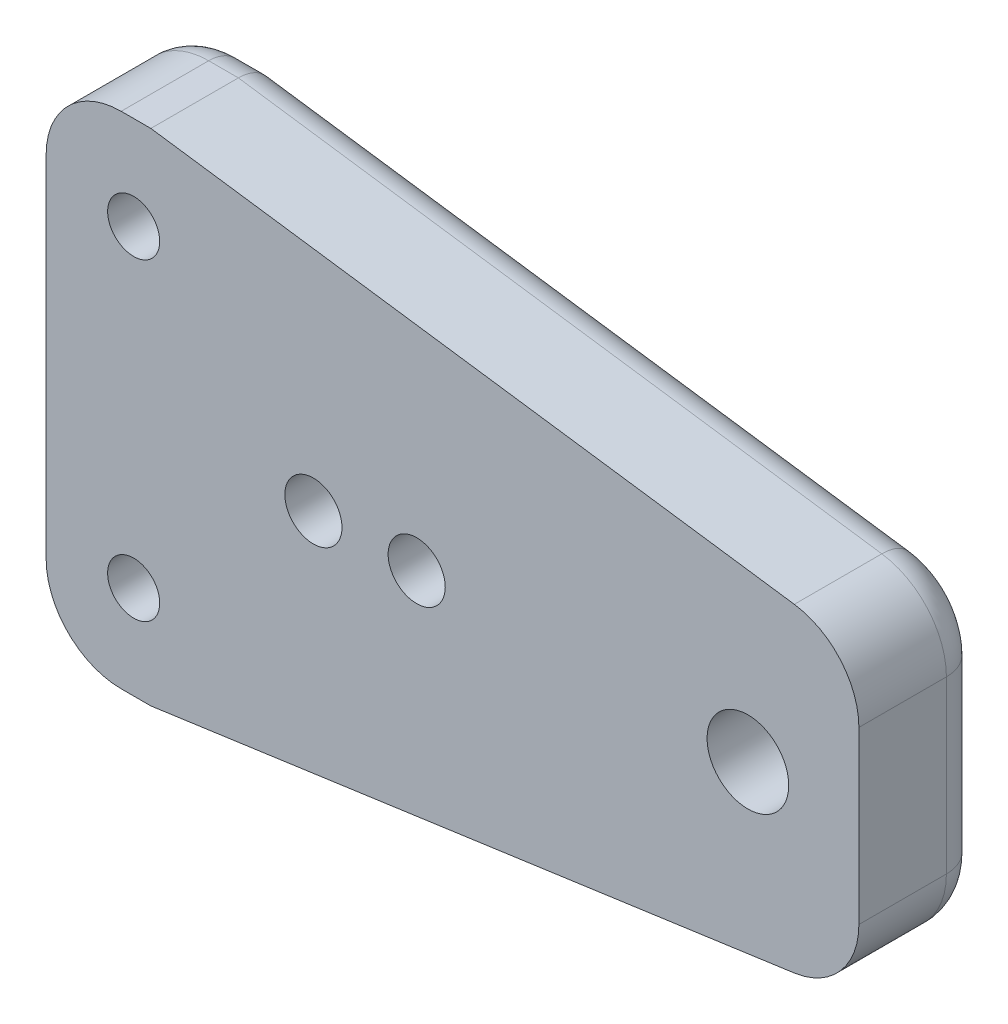
ISO-10303-21;
HEADER;
FILE_DESCRIPTION(('STEP AP214'),'2;1');
FILE_NAME('part.step','',(''),(''),'','','');
FILE_SCHEMA(('AUTOMOTIVE_DESIGN { 1 0 10303 214 1 1 1 1 }'));
ENDSEC;
DATA;
#1=APPLICATION_CONTEXT('core data for automotive mechanical design processes');
#2=APPLICATION_PROTOCOL_DEFINITION('international standard','automotive_design',2000,#1);
#3=PRODUCT_CONTEXT('',#1,'mechanical');
#4=PRODUCT('Part','Part','',(#3));
#5=PRODUCT_RELATED_PRODUCT_CATEGORY('part','',(#4));
#6=PRODUCT_DEFINITION_FORMATION('','',#4);
#7=PRODUCT_DEFINITION_CONTEXT('part definition',#1,'design');
#8=PRODUCT_DEFINITION('design','',#6,#7);
#9=PRODUCT_DEFINITION_SHAPE('','',#8);
#10=(LENGTH_UNIT() NAMED_UNIT(*) SI_UNIT(.MILLI.,.METRE.));
#11=(NAMED_UNIT(*) PLANE_ANGLE_UNIT() SI_UNIT($,.RADIAN.));
#12=(NAMED_UNIT(*) SI_UNIT($,.STERADIAN.) SOLID_ANGLE_UNIT());
#13=UNCERTAINTY_MEASURE_WITH_UNIT(LENGTH_MEASURE(1.E-05),#10,'distance_accuracy_value','');
#14=(GEOMETRIC_REPRESENTATION_CONTEXT(3) GLOBAL_UNCERTAINTY_ASSIGNED_CONTEXT((#13)) GLOBAL_UNIT_ASSIGNED_CONTEXT((#10,
#11,#12)) REPRESENTATION_CONTEXT('',''));
#15=CARTESIAN_POINT('',(0.,0.,0.));
#16=DIRECTION('',(0.,0.,1.));
#17=DIRECTION('',(1.,0.,0.));
#18=AXIS2_PLACEMENT_3D('',#15,#16,#17);
#19=CARTESIAN_POINT('',(-37.1241261867414,-6.82608205189177,10.));
#20=DIRECTION('',(0.,0.,-1.));
#21=DIRECTION('',(-1.,0.,0.));
#22=AXIS2_PLACEMENT_3D('',#19,#20,#21);
#23=PLANE('',#22);
#24=CARTESIAN_POINT('',(-74.7495761867413,0.,10.));
#25=DIRECTION('',(0.,0.,1.));
#26=DIRECTION('',(1.,0.,0.));
#27=AXIS2_PLACEMENT_3D('',#24,#25,#26);
#28=CIRCLE('',#27,2.28499999999999);
#29=CARTESIAN_POINT('',(-72.4645761867413,0.,10.));
#30=VERTEX_POINT('',#29);
#31=EDGE_CURVE('E300',#30,#30,#28,.T.);
#32=ORIENTED_EDGE('',*,*,#31,.F.);
#33=EDGE_LOOP('',(#32));
#34=FACE_BOUND('',#33,.T.);
#35=CARTESIAN_POINT('',(-66.4895761867413,0.,10.));
#36=DIRECTION('',(0.,0.,1.));
#37=DIRECTION('',(1.,0.,0.));
#38=AXIS2_PLACEMENT_3D('',#35,#36,#37);
#39=CIRCLE('',#38,2.28499999999999);
#40=CARTESIAN_POINT('',(-64.2045761867413,0.,10.));
#41=VERTEX_POINT('',#40);
#42=EDGE_CURVE('E306',#41,#41,#39,.T.);
#43=ORIENTED_EDGE('',*,*,#42,.F.);
#44=EDGE_LOOP('',(#43));
#45=FACE_BOUND('',#44,.T.);
#46=CARTESIAN_POINT('',(-40.,0.,10.));
#47=DIRECTION('',(0.,0.,1.));
#48=DIRECTION('',(1.,0.,0.));
#49=AXIS2_PLACEMENT_3D('',#46,#47,#48);
#50=CIRCLE('',#49,3.2639);
#51=CARTESIAN_POINT('',(-36.7361,0.,10.));
#52=VERTEX_POINT('',#51);
#53=EDGE_CURVE('E321',#52,#52,#50,.T.);
#54=ORIENTED_EDGE('',*,*,#53,.F.);
#55=EDGE_LOOP('',(#54));
#56=FACE_BOUND('',#55,.T.);
#57=CARTESIAN_POINT('',(-37.1241261867414,-6.82608205189177,10.));
#58=DIRECTION('',(0.,0.,1.));
#59=DIRECTION('',(-1.,0.,0.));
#60=AXIS2_PLACEMENT_3D('',#57,#58,#59);
#61=CIRCLE('',#60,6.);
#62=CARTESIAN_POINT('',(-36.2890875809811,-12.7676904643412,10.0000000000001));
#63=VERTEX_POINT('',#62);
#64=CARTESIAN_POINT('',(-31.1241261867414,-6.82608205189174,10.));
#65=VERTEX_POINT('',#64);
#66=EDGE_CURVE('E156',#63,#65,#61,.T.);
#67=ORIENTED_EDGE('',*,*,#66,.T.);
#68=DIRECTION('',(0.,1.,0.));
#69=VECTOR('',#68,1.);
#70=CARTESIAN_POINT('',(-31.1241261867414,6.82608205189166,9.99999999999997));
#71=LINE('',#70,#69);
#72=CARTESIAN_POINT('',(-31.1241261867414,6.82608205189166,9.99999999999997));
#73=VERTEX_POINT('',#72);
#74=EDGE_CURVE('E145',#65,#73,#71,.T.);
#75=ORIENTED_EDGE('',*,*,#74,.T.);
#76=CARTESIAN_POINT('',(-37.1241261867414,6.8260820518917,9.99999999999997));
#77=DIRECTION('',(0.,0.,1.));
#78=DIRECTION('',(-1.,0.,0.));
#79=AXIS2_PLACEMENT_3D('',#76,#77,#78);
#80=CIRCLE('',#79,6.);
#81=CARTESIAN_POINT('',(-36.2890875809811,12.7676904643411,9.99999999999993));
#82=VERTEX_POINT('',#81);
#83=EDGE_CURVE('E155',#73,#82,#80,.T.);
#84=ORIENTED_EDGE('',*,*,#83,.T.);
#85=DIRECTION('',(-0.990268068741571,0.139173100960058,0.));
#86=VECTOR('',#85,1.);
#87=CARTESIAN_POINT('',(-36.2890875809811,12.7676904643411,9.99999999999993));
#88=LINE('',#87,#86);
#89=CARTESIAN_POINT('',(-87.7496438739211,20.,9.9999999999999));
#90=VERTEX_POINT('',#89);
#91=EDGE_CURVE('E275',#82,#90,#88,.T.);
#92=ORIENTED_EDGE('',*,*,#91,.T.);
#93=DIRECTION('',(-1.,0.,0.));
#94=VECTOR('',#93,1.);
#95=CARTESIAN_POINT('',(-90.1241261867413,20.,9.9999999999999));
#96=LINE('',#95,#94);
#97=CARTESIAN_POINT('',(-90.1241261867413,20.,9.9999999999999));
#98=VERTEX_POINT('',#97);
#99=EDGE_CURVE('E331',#90,#98,#96,.T.);
#100=ORIENTED_EDGE('',*,*,#99,.T.);
#101=CARTESIAN_POINT('',(-90.1241261867413,13.9999999999999,9.99999999999993));
#102=DIRECTION('',(0.,0.,1.));
#103=DIRECTION('',(1.,0.,0.));
#104=AXIS2_PLACEMENT_3D('',#101,#102,#103);
#105=CIRCLE('',#104,6.);
#106=CARTESIAN_POINT('',(-96.1241261867413,13.9999999999999,9.99999999999993));
#107=VERTEX_POINT('',#106);
#108=EDGE_CURVE('E333',#98,#107,#105,.T.);
#109=ORIENTED_EDGE('',*,*,#108,.T.);
#110=DIRECTION('',(0.,-1.,0.));
#111=VECTOR('',#110,1.);
#112=CARTESIAN_POINT('',(-96.1241261867413,13.9999999999999,9.99999999999993));
#113=LINE('',#112,#111);
#114=CARTESIAN_POINT('',(-96.1241261867413,-14.,10.));
#115=VERTEX_POINT('',#114);
#116=EDGE_CURVE('E335',#107,#115,#113,.T.);
#117=ORIENTED_EDGE('',*,*,#116,.T.);
#118=CARTESIAN_POINT('',(-90.1241261867413,-14.0000000000001,10.));
#119=DIRECTION('',(0.,0.,1.));
#120=DIRECTION('',(-1.,0.,0.));
#121=AXIS2_PLACEMENT_3D('',#118,#119,#120);
#122=CIRCLE('',#121,6.);
#123=CARTESIAN_POINT('',(-90.1241261867413,-20.,10.0000000000001));
#124=VERTEX_POINT('',#123);
#125=EDGE_CURVE('E229',#115,#124,#122,.T.);
#126=ORIENTED_EDGE('',*,*,#125,.T.);
#127=DIRECTION('',(1.,0.,0.));
#128=VECTOR('',#127,1.);
#129=CARTESIAN_POINT('',(-90.1241261867413,-20.,10.0000000000001));
#130=LINE('',#129,#128);
#131=CARTESIAN_POINT('',(-87.7496438739211,-20.0000000000001,10.0000000000001));
#132=VERTEX_POINT('',#131);
#133=EDGE_CURVE('E338',#124,#132,#130,.T.);
#134=ORIENTED_EDGE('',*,*,#133,.T.);
#135=DIRECTION('',(0.990268068741571,0.139173100960058,0.));
#136=VECTOR('',#135,1.);
#137=CARTESIAN_POINT('',(-36.2890875809811,-12.7676904643412,10.0000000000001));
#138=LINE('',#137,#136);
#139=EDGE_CURVE('E161',#132,#63,#138,.T.);
#140=ORIENTED_EDGE('',*,*,#139,.T.);
#141=EDGE_LOOP('',(#67,#75,#84,#92,#100,#109,#117,#126,#134,#140));
#142=FACE_BOUND('',#141,.T.);
#143=CARTESIAN_POINT('',(-89.1241261867413,12.5255790864052,9.99999999999993));
#144=DIRECTION('',(0.,0.,1.));
#145=DIRECTION('',(1.,0.,0.));
#146=AXIS2_PLACEMENT_3D('',#143,#144,#145);
#147=CIRCLE('',#146,2.0828);
#148=CARTESIAN_POINT('',(-87.0413261867413,12.5255790864052,9.99999999999993));
#149=VERTEX_POINT('',#148);
#150=EDGE_CURVE('E165',#149,#149,#147,.T.);
#151=ORIENTED_EDGE('',*,*,#150,.F.);
#152=EDGE_LOOP('',(#151));
#153=FACE_BOUND('',#152,.T.);
#154=CARTESIAN_POINT('',(-89.1241261867413,-12.5255790864053,10.));
#155=DIRECTION('',(0.,0.,1.));
#156=DIRECTION('',(1.,0.,0.));
#157=AXIS2_PLACEMENT_3D('',#154,#155,#156);
#158=CIRCLE('',#157,2.0828);
#159=CARTESIAN_POINT('',(-87.0413261867413,-12.5255790864053,10.));
#160=VERTEX_POINT('',#159);
#161=EDGE_CURVE('E315',#160,#160,#158,.T.);
#162=ORIENTED_EDGE('',*,*,#161,.F.);
#163=EDGE_LOOP('',(#162));
#164=FACE_BOUND('',#163,.T.);
#165=ADVANCED_FACE('F37',(#34,#45,#56,#142,#153,#164),#23,.F.);
#166=CARTESIAN_POINT('',(-37.1241261867414,-6.82608205189173,0.));
#167=DIRECTION('',(0.,0.,-1.));
#168=DIRECTION('',(-1.,0.,0.));
#169=AXIS2_PLACEMENT_3D('',#166,#167,#168);
#170=PLANE('',#169);
#171=CARTESIAN_POINT('',(-37.1241261867414,-6.82608205189173,0.));
#172=DIRECTION('',(0.,0.,-1.));
#173=DIRECTION('',(-1.,0.,0.));
#174=AXIS2_PLACEMENT_3D('',#171,#172,#173);
#175=CIRCLE('',#174,3.);
#176=CARTESIAN_POINT('',(-34.1241261867414,-6.82608205189172,0.));
#177=VERTEX_POINT('',#176);
#178=CARTESIAN_POINT('',(-36.7066068838613,-9.79688625811645,0.));
#179=VERTEX_POINT('',#178);
#180=EDGE_CURVE('E193',#177,#179,#175,.T.);
#181=ORIENTED_EDGE('',*,*,#180,.T.);
#182=DIRECTION('',(0.990268068741571,0.139173100960058,0.));
#183=VECTOR('',#182,1.);
#184=CARTESIAN_POINT('',(-88.1671631768014,-17.0291957937753,0.));
#185=LINE('',#184,#183);
#186=CARTESIAN_POINT('',(-87.9594243097518,-17.,0.));
#187=VERTEX_POINT('',#186);
#188=EDGE_CURVE('E195',#179,#187,#185,.F.);
#189=ORIENTED_EDGE('',*,*,#188,.T.);
#190=DIRECTION('',(1.,0.,0.));
#191=VECTOR('',#190,1.);
#192=CARTESIAN_POINT('',(-90.1241261867413,-17.,0.));
#193=LINE('',#192,#191);
#194=CARTESIAN_POINT('',(-90.1241261867413,-17.,0.));
#195=VERTEX_POINT('',#194);
#196=EDGE_CURVE('E187',#187,#195,#193,.F.);
#197=ORIENTED_EDGE('',*,*,#196,.T.);
#198=CARTESIAN_POINT('',(-90.1241261867414,-14.,0.));
#199=DIRECTION('',(0.,0.,-1.));
#200=DIRECTION('',(-1.,0.,0.));
#201=AXIS2_PLACEMENT_3D('',#198,#199,#200);
#202=CIRCLE('',#201,3.);
#203=CARTESIAN_POINT('',(-93.1241261867414,-14.,0.));
#204=VERTEX_POINT('',#203);
#205=EDGE_CURVE('E185',#195,#204,#202,.T.);
#206=ORIENTED_EDGE('',*,*,#205,.T.);
#207=DIRECTION('',(0.,-1.,0.));
#208=VECTOR('',#207,1.);
#209=CARTESIAN_POINT('',(-93.1241261867414,13.9999999999999,0.));
#210=LINE('',#209,#208);
#211=CARTESIAN_POINT('',(-93.1241261867414,13.9999999999999,0.));
#212=VERTEX_POINT('',#211);
#213=EDGE_CURVE('E183',#204,#212,#210,.F.);
#214=ORIENTED_EDGE('',*,*,#213,.T.);
#215=CARTESIAN_POINT('',(-90.1241261867414,14.,0.));
#216=DIRECTION('',(0.,0.,-1.));
#217=DIRECTION('',(-1.,0.,0.));
#218=AXIS2_PLACEMENT_3D('',#215,#216,#217);
#219=CIRCLE('',#218,3.);
#220=CARTESIAN_POINT('',(-90.1241261867413,17.,0.));
#221=VERTEX_POINT('',#220);
#222=EDGE_CURVE('E172',#212,#221,#219,.T.);
#223=ORIENTED_EDGE('',*,*,#222,.T.);
#224=DIRECTION('',(-1.,0.,0.));
#225=VECTOR('',#224,1.);
#226=CARTESIAN_POINT('',(-87.7496438739212,17.,0.));
#227=LINE('',#226,#225);
#228=CARTESIAN_POINT('',(-87.9594243097518,17.,0.));
#229=VERTEX_POINT('',#228);
#230=EDGE_CURVE('E179',#221,#229,#227,.F.);
#231=ORIENTED_EDGE('',*,*,#230,.T.);
#232=DIRECTION('',(-0.990268068741571,0.139173100960058,0.));
#233=VECTOR('',#232,1.);
#234=CARTESIAN_POINT('',(-36.7066068838613,9.79688625811645,0.));
#235=LINE('',#234,#233);
#236=CARTESIAN_POINT('',(-36.7066068838612,9.79688625811645,0.));
#237=VERTEX_POINT('',#236);
#238=EDGE_CURVE('E181',#229,#237,#235,.F.);
#239=ORIENTED_EDGE('',*,*,#238,.T.);
#240=CARTESIAN_POINT('',(-37.1241261867414,6.82608205189174,0.));
#241=DIRECTION('',(0.,0.,-1.));
#242=DIRECTION('',(-1.,0.,0.));
#243=AXIS2_PLACEMENT_3D('',#240,#241,#242);
#244=CIRCLE('',#243,3.);
#245=CARTESIAN_POINT('',(-34.1241261867414,6.8260820518917,0.));
#246=VERTEX_POINT('',#245);
#247=EDGE_CURVE('E189',#237,#246,#244,.T.);
#248=ORIENTED_EDGE('',*,*,#247,.T.);
#249=DIRECTION('',(0.,1.,0.));
#250=VECTOR('',#249,1.);
#251=CARTESIAN_POINT('',(-34.1241261867414,-6.8260820518917,0.));
#252=LINE('',#251,#250);
#253=EDGE_CURVE('E191',#246,#177,#252,.F.);
#254=ORIENTED_EDGE('',*,*,#253,.T.);
#255=EDGE_LOOP('',(#181,#189,#197,#206,#214,#223,#231,#239,#248,#254));
#256=FACE_BOUND('',#255,.T.);
#257=CARTESIAN_POINT('',(-74.7495761867414,0.,0.));
#258=DIRECTION('',(0.,0.,1.));
#259=DIRECTION('',(1.,0.,0.));
#260=AXIS2_PLACEMENT_3D('',#257,#258,#259);
#261=CIRCLE('',#260,2.28499999999999);
#262=CARTESIAN_POINT('',(-72.4645761867414,0.,0.));
#263=VERTEX_POINT('',#262);
#264=EDGE_CURVE('E303',#263,#263,#261,.T.);
#265=ORIENTED_EDGE('',*,*,#264,.T.);
#266=EDGE_LOOP('',(#265));
#267=FACE_BOUND('',#266,.T.);
#268=CARTESIAN_POINT('',(-66.4895761867414,0.,0.));
#269=DIRECTION('',(0.,0.,1.));
#270=DIRECTION('',(1.,0.,0.));
#271=AXIS2_PLACEMENT_3D('',#268,#269,#270);
#272=CIRCLE('',#271,2.28499999999999);
#273=CARTESIAN_POINT('',(-64.2045761867414,0.,0.));
#274=VERTEX_POINT('',#273);
#275=EDGE_CURVE('E309',#274,#274,#272,.T.);
#276=ORIENTED_EDGE('',*,*,#275,.T.);
#277=EDGE_LOOP('',(#276));
#278=FACE_BOUND('',#277,.T.);
#279=CARTESIAN_POINT('',(-40.,0.,0.));
#280=DIRECTION('',(0.,0.,1.));
#281=DIRECTION('',(1.,0.,0.));
#282=AXIS2_PLACEMENT_3D('',#279,#280,#281);
#283=CIRCLE('',#282,3.2639);
#284=CARTESIAN_POINT('',(-36.7361,0.,0.));
#285=VERTEX_POINT('',#284);
#286=EDGE_CURVE('E318',#285,#285,#283,.T.);
#287=ORIENTED_EDGE('',*,*,#286,.T.);
#288=EDGE_LOOP('',(#287));
#289=FACE_BOUND('',#288,.T.);
#290=CARTESIAN_POINT('',(-89.1241261867414,12.5255790864053,0.));
#291=DIRECTION('',(0.,0.,1.));
#292=DIRECTION('',(1.,0.,0.));
#293=AXIS2_PLACEMENT_3D('',#290,#291,#292);
#294=CIRCLE('',#293,2.0828);
#295=CARTESIAN_POINT('',(-87.0413261867414,12.5255790864053,0.));
#296=VERTEX_POINT('',#295);
#297=EDGE_CURVE('E324',#296,#296,#294,.T.);
#298=ORIENTED_EDGE('',*,*,#297,.T.);
#299=EDGE_LOOP('',(#298));
#300=FACE_BOUND('',#299,.T.);
#301=CARTESIAN_POINT('',(-89.1241261867414,-12.5255790864053,0.));
#302=DIRECTION('',(0.,0.,1.));
#303=DIRECTION('',(1.,0.,0.));
#304=AXIS2_PLACEMENT_3D('',#301,#302,#303);
#305=CIRCLE('',#304,2.0828);
#306=CARTESIAN_POINT('',(-87.0413261867414,-12.5255790864053,0.));
#307=VERTEX_POINT('',#306);
#308=EDGE_CURVE('E312',#307,#307,#305,.T.);
#309=ORIENTED_EDGE('',*,*,#308,.T.);
#310=EDGE_LOOP('',(#309));
#311=FACE_BOUND('',#310,.T.);
#312=ADVANCED_FACE('F350',(#256,#267,#278,#289,#300,#311),#170,.T.);
#313=CARTESIAN_POINT('',(-37.1241261867414,-6.82608205189177,10.));
#314=DIRECTION('',(0.,0.,-1.));
#315=DIRECTION('',(-1.,0.,0.));
#316=AXIS2_PLACEMENT_3D('',#313,#314,#315);
#317=CYLINDRICAL_SURFACE('',#316,6.);
#318=DIRECTION('',(0.,0.,-1.));
#319=VECTOR('',#318,1.);
#320=CARTESIAN_POINT('',(-36.2890875809811,-12.7676904643412,10.0000000000001));
#321=LINE('',#320,#319);
#322=CARTESIAN_POINT('',(-36.2890875809811,-12.7676904643412,3.00000000000006));
#323=VERTEX_POINT('',#322);
#324=EDGE_CURVE('E262',#63,#323,#321,.T.);
#325=ORIENTED_EDGE('',*,*,#324,.T.);
#326=CARTESIAN_POINT('',(-37.1241261867414,-6.82608205189174,3.00000000000003));
#327=DIRECTION('',(0.,0.,-1.));
#328=DIRECTION('',(-1.,0.,0.));
#329=AXIS2_PLACEMENT_3D('',#326,#327,#328);
#330=CIRCLE('',#329,6.);
#331=CARTESIAN_POINT('',(-31.1241261867414,-6.82608205189171,3.00000000000003));
#332=VERTEX_POINT('',#331);
#333=EDGE_CURVE('E168',#323,#332,#330,.F.);
#334=ORIENTED_EDGE('',*,*,#333,.T.);
#335=DIRECTION('',(0.,0.,-1.));
#336=VECTOR('',#335,1.);
#337=CARTESIAN_POINT('',(-31.1241261867414,-6.82608205189174,10.));
#338=LINE('',#337,#336);
#339=EDGE_CURVE('E149',#65,#332,#338,.T.);
#340=ORIENTED_EDGE('',*,*,#339,.F.);
#341=ORIENTED_EDGE('',*,*,#66,.F.);
#342=EDGE_LOOP('',(#325,#334,#340,#341));
#343=FACE_BOUND('',#342,.T.);
#344=ADVANCED_FACE('F39',(#343),#317,.T.);
#345=CARTESIAN_POINT('',(-31.1241261867414,6.82608205189166,9.99999999999997));
#346=DIRECTION('',(-1.,0.,0.));
#347=DIRECTION('',(0.,0.,1.));
#348=AXIS2_PLACEMENT_3D('',#345,#346,#347);
#349=PLANE('',#348);
#350=ORIENTED_EDGE('',*,*,#339,.T.);
#351=DIRECTION('',(0.,1.,0.));
#352=VECTOR('',#351,1.);
#353=CARTESIAN_POINT('',(-31.1241261867414,6.82608205189169,2.99999999999997));
#354=LINE('',#353,#352);
#355=CARTESIAN_POINT('',(-31.1241261867414,6.82608205189169,2.99999999999997));
#356=VERTEX_POINT('',#355);
#357=EDGE_CURVE('E199',#332,#356,#354,.T.);
#358=ORIENTED_EDGE('',*,*,#357,.T.);
#359=DIRECTION('',(0.,0.,-1.));
#360=VECTOR('',#359,1.);
#361=CARTESIAN_POINT('',(-31.1241261867414,6.82608205189166,9.99999999999997));
#362=LINE('',#361,#360);
#363=EDGE_CURVE('E152',#73,#356,#362,.T.);
#364=ORIENTED_EDGE('',*,*,#363,.F.);
#365=ORIENTED_EDGE('',*,*,#74,.F.);
#366=EDGE_LOOP('',(#350,#358,#364,#365));
#367=FACE_BOUND('',#366,.T.);
#368=ADVANCED_FACE('F147',(#367),#349,.F.);
#369=CARTESIAN_POINT('',(-37.1241261867414,6.8260820518917,9.99999999999997));
#370=DIRECTION('',(0.,0.,-1.));
#371=DIRECTION('',(-1.,0.,0.));
#372=AXIS2_PLACEMENT_3D('',#369,#370,#371);
#373=CYLINDRICAL_SURFACE('',#372,6.);
#374=ORIENTED_EDGE('',*,*,#363,.T.);
#375=CARTESIAN_POINT('',(-37.1241261867414,6.82608205189173,2.99999999999997));
#376=DIRECTION('',(0.,0.,-1.));
#377=DIRECTION('',(-1.,0.,0.));
#378=AXIS2_PLACEMENT_3D('',#375,#376,#377);
#379=CIRCLE('',#378,6.);
#380=CARTESIAN_POINT('',(-36.2890875809811,12.7676904643411,2.99999999999994));
#381=VERTEX_POINT('',#380);
#382=EDGE_CURVE('E201',#356,#381,#379,.F.);
#383=ORIENTED_EDGE('',*,*,#382,.T.);
#384=DIRECTION('',(0.,0.,-1.));
#385=VECTOR('',#384,1.);
#386=CARTESIAN_POINT('',(-36.2890875809811,12.7676904643411,9.99999999999993));
#387=LINE('',#386,#385);
#388=EDGE_CURVE('E174',#82,#381,#387,.T.);
#389=ORIENTED_EDGE('',*,*,#388,.F.);
#390=ORIENTED_EDGE('',*,*,#83,.F.);
#391=EDGE_LOOP('',(#374,#383,#389,#390));
#392=FACE_BOUND('',#391,.T.);
#393=ADVANCED_FACE('F403',(#392),#373,.T.);
#394=CARTESIAN_POINT('',(-36.2890875809811,12.7676904643411,9.99999999999993));
#395=DIRECTION('',(-0.139173100960058,-0.990268068741571,0.));
#396=DIRECTION('',(0.990268068741571,-0.139173100960058,0.));
#397=AXIS2_PLACEMENT_3D('',#394,#395,#396);
#398=PLANE('',#397);
#399=ORIENTED_EDGE('',*,*,#388,.T.);
#400=DIRECTION('',(-0.990268068741571,0.139173100960058,0.));
#401=VECTOR('',#400,1.);
#402=CARTESIAN_POINT('',(-87.7496438739211,20.,2.99999999999991));
#403=LINE('',#402,#401);
#404=CARTESIAN_POINT('',(-87.7496438739211,20.,2.99999999999991));
#405=VERTEX_POINT('',#404);
#406=EDGE_CURVE('E59',#381,#405,#403,.T.);
#407=ORIENTED_EDGE('',*,*,#406,.T.);
#408=DIRECTION('',(0.,0.,-1.));
#409=VECTOR('',#408,1.);
#410=CARTESIAN_POINT('',(-87.7496438739211,20.,9.9999999999999));
#411=LINE('',#410,#409);
#412=EDGE_CURVE('E271',#90,#405,#411,.T.);
#413=ORIENTED_EDGE('',*,*,#412,.F.);
#414=ORIENTED_EDGE('',*,*,#91,.F.);
#415=EDGE_LOOP('',(#399,#407,#413,#414));
#416=FACE_BOUND('',#415,.T.);
#417=ADVANCED_FACE('F274',(#416),#398,.F.);
#418=CARTESIAN_POINT('',(-90.1241261867413,20.,9.9999999999999));
#419=DIRECTION('',(0.,-1.,0.));
#420=DIRECTION('',(1.,0.,0.));
#421=AXIS2_PLACEMENT_3D('',#418,#419,#420);
#422=PLANE('',#421);
#423=ORIENTED_EDGE('',*,*,#412,.T.);
#424=DIRECTION('',(-1.,0.,0.));
#425=VECTOR('',#424,1.);
#426=CARTESIAN_POINT('',(-90.1241261867413,20.,2.99999999999991));
#427=LINE('',#426,#425);
#428=CARTESIAN_POINT('',(-90.1241261867413,20.,2.99999999999991));
#429=VERTEX_POINT('',#428);
#430=EDGE_CURVE('E45',#405,#429,#427,.T.);
#431=ORIENTED_EDGE('',*,*,#430,.T.);
#432=DIRECTION('',(0.,0.,-1.));
#433=VECTOR('',#432,1.);
#434=CARTESIAN_POINT('',(-90.1241261867413,20.,9.9999999999999));
#435=LINE('',#434,#433);
#436=EDGE_CURVE('E269',#98,#429,#435,.T.);
#437=ORIENTED_EDGE('',*,*,#436,.F.);
#438=ORIENTED_EDGE('',*,*,#99,.F.);
#439=EDGE_LOOP('',(#423,#431,#437,#438));
#440=FACE_BOUND('',#439,.T.);
#441=ADVANCED_FACE('F398',(#440),#422,.F.);
#442=CARTESIAN_POINT('',(-90.1241261867413,13.9999999999999,9.99999999999993));
#443=DIRECTION('',(0.,0.,-1.));
#444=DIRECTION('',(-1.,0.,0.));
#445=AXIS2_PLACEMENT_3D('',#442,#443,#444);
#446=CYLINDRICAL_SURFACE('',#445,6.);
#447=ORIENTED_EDGE('',*,*,#436,.T.);
#448=CARTESIAN_POINT('',(-90.1241261867413,14.,2.99999999999993));
#449=DIRECTION('',(0.,0.,-1.));
#450=DIRECTION('',(-1.,0.,0.));
#451=AXIS2_PLACEMENT_3D('',#448,#449,#450);
#452=CIRCLE('',#451,6.);
#453=CARTESIAN_POINT('',(-96.1241261867413,13.9999999999999,2.99999999999993));
#454=VERTEX_POINT('',#453);
#455=EDGE_CURVE('E11',#429,#454,#452,.F.);
#456=ORIENTED_EDGE('',*,*,#455,.T.);
#457=DIRECTION('',(0.,0.,-1.));
#458=VECTOR('',#457,1.);
#459=CARTESIAN_POINT('',(-96.1241261867413,13.9999999999999,9.99999999999993));
#460=LINE('',#459,#458);
#461=EDGE_CURVE('E219',#107,#454,#460,.T.);
#462=ORIENTED_EDGE('',*,*,#461,.F.);
#463=ORIENTED_EDGE('',*,*,#108,.F.);
#464=EDGE_LOOP('',(#447,#456,#462,#463));
#465=FACE_BOUND('',#464,.T.);
#466=ADVANCED_FACE('F342',(#465),#446,.T.);
#467=CARTESIAN_POINT('',(-96.1241261867413,13.9999999999999,9.99999999999993));
#468=DIRECTION('',(1.,0.,0.));
#469=DIRECTION('',(0.,0.,-1.));
#470=AXIS2_PLACEMENT_3D('',#467,#468,#469);
#471=PLANE('',#470);
#472=ORIENTED_EDGE('',*,*,#461,.T.);
#473=DIRECTION('',(0.,-1.,0.));
#474=VECTOR('',#473,1.);
#475=CARTESIAN_POINT('',(-96.1241261867413,-14.,3.00000000000006));
#476=LINE('',#475,#474);
#477=CARTESIAN_POINT('',(-96.1241261867413,-14.,3.00000000000006));
#478=VERTEX_POINT('',#477);
#479=EDGE_CURVE('E207',#454,#478,#476,.T.);
#480=ORIENTED_EDGE('',*,*,#479,.T.);
#481=DIRECTION('',(0.,0.,-1.));
#482=VECTOR('',#481,1.);
#483=CARTESIAN_POINT('',(-96.1241261867413,-14.,10.));
#484=LINE('',#483,#482);
#485=EDGE_CURVE('E216',#115,#478,#484,.T.);
#486=ORIENTED_EDGE('',*,*,#485,.F.);
#487=ORIENTED_EDGE('',*,*,#116,.F.);
#488=EDGE_LOOP('',(#472,#480,#486,#487));
#489=FACE_BOUND('',#488,.T.);
#490=ADVANCED_FACE('F214',(#489),#471,.F.);
#491=CARTESIAN_POINT('',(-90.1241261867413,-14.0000000000001,10.));
#492=DIRECTION('',(0.,0.,-1.));
#493=DIRECTION('',(-1.,0.,0.));
#494=AXIS2_PLACEMENT_3D('',#491,#492,#493);
#495=CYLINDRICAL_SURFACE('',#494,6.);
#496=ORIENTED_EDGE('',*,*,#485,.T.);
#497=CARTESIAN_POINT('',(-90.1241261867413,-14.,3.00000000000006));
#498=DIRECTION('',(0.,0.,-1.));
#499=DIRECTION('',(-1.,0.,0.));
#500=AXIS2_PLACEMENT_3D('',#497,#498,#499);
#501=CIRCLE('',#500,6.);
#502=CARTESIAN_POINT('',(-90.1241261867413,-20.,3.00000000000009));
#503=VERTEX_POINT('',#502);
#504=EDGE_CURVE('E205',#478,#503,#501,.F.);
#505=ORIENTED_EDGE('',*,*,#504,.T.);
#506=DIRECTION('',(0.,0.,-1.));
#507=VECTOR('',#506,1.);
#508=CARTESIAN_POINT('',(-90.1241261867413,-20.,10.0000000000001));
#509=LINE('',#508,#507);
#510=EDGE_CURVE('E230',#124,#503,#509,.T.);
#511=ORIENTED_EDGE('',*,*,#510,.F.);
#512=ORIENTED_EDGE('',*,*,#125,.F.);
#513=EDGE_LOOP('',(#496,#505,#511,#512));
#514=FACE_BOUND('',#513,.T.);
#515=ADVANCED_FACE('F225',(#514),#495,.T.);
#516=CARTESIAN_POINT('',(-90.1241261867413,-20.,10.0000000000001));
#517=DIRECTION('',(0.,1.,0.));
#518=DIRECTION('',(-1.,0.,0.));
#519=AXIS2_PLACEMENT_3D('',#516,#517,#518);
#520=PLANE('',#519);
#521=ORIENTED_EDGE('',*,*,#510,.T.);
#522=DIRECTION('',(1.,0.,0.));
#523=VECTOR('',#522,1.);
#524=CARTESIAN_POINT('',(-87.7496438739211,-20.,3.00000000000009));
#525=LINE('',#524,#523);
#526=CARTESIAN_POINT('',(-87.7496438739211,-20.,3.00000000000009));
#527=VERTEX_POINT('',#526);
#528=EDGE_CURVE('E203',#503,#527,#525,.T.);
#529=ORIENTED_EDGE('',*,*,#528,.T.);
#530=DIRECTION('',(0.,0.,-1.));
#531=VECTOR('',#530,1.);
#532=CARTESIAN_POINT('',(-87.7496438739211,-20.0000000000001,10.0000000000001));
#533=LINE('',#532,#531);
#534=EDGE_CURVE('E259',#132,#527,#533,.T.);
#535=ORIENTED_EDGE('',*,*,#534,.F.);
#536=ORIENTED_EDGE('',*,*,#133,.F.);
#537=EDGE_LOOP('',(#521,#529,#535,#536));
#538=FACE_BOUND('',#537,.T.);
#539=ADVANCED_FACE('F257',(#538),#520,.F.);
#540=CARTESIAN_POINT('',(-36.2890875809811,-12.7676904643412,10.0000000000001));
#541=DIRECTION('',(-0.139173100960058,0.990268068741571,0.));
#542=DIRECTION('',(-0.990268068741571,-0.139173100960058,0.));
#543=AXIS2_PLACEMENT_3D('',#540,#541,#542);
#544=PLANE('',#543);
#545=ORIENTED_EDGE('',*,*,#534,.T.);
#546=DIRECTION('',(0.990268068741571,0.139173100960058,0.));
#547=VECTOR('',#546,1.);
#548=CARTESIAN_POINT('',(-36.2890875809811,-12.7676904643412,3.00000000000006));
#549=LINE('',#548,#547);
#550=EDGE_CURVE('E169',#527,#323,#549,.T.);
#551=ORIENTED_EDGE('',*,*,#550,.T.);
#552=ORIENTED_EDGE('',*,*,#324,.F.);
#553=ORIENTED_EDGE('',*,*,#139,.F.);
#554=EDGE_LOOP('',(#545,#551,#552,#553));
#555=FACE_BOUND('',#554,.T.);
#556=ADVANCED_FACE('F261',(#555),#544,.F.);
#557=CARTESIAN_POINT('',(-89.1241261867413,12.5255790864052,9.99999999999993));
#558=DIRECTION('',(0.,0.,-1.));
#559=DIRECTION('',(-1.,0.,0.));
#560=AXIS2_PLACEMENT_3D('',#557,#558,#559);
#561=CYLINDRICAL_SURFACE('',#560,2.0828);
#562=ORIENTED_EDGE('',*,*,#150,.T.);
#563=EDGE_LOOP('',(#562));
#564=FACE_BOUND('',#563,.T.);
#565=ORIENTED_EDGE('',*,*,#297,.F.);
#566=EDGE_LOOP('',(#565));
#567=FACE_BOUND('',#566,.T.);
#568=ADVANCED_FACE('F389',(#564,#567),#561,.F.);
#569=CARTESIAN_POINT('',(-40.,0.,10.));
#570=DIRECTION('',(0.,0.,-1.));
#571=DIRECTION('',(-1.,0.,0.));
#572=AXIS2_PLACEMENT_3D('',#569,#570,#571);
#573=CYLINDRICAL_SURFACE('',#572,3.2639);
#574=ORIENTED_EDGE('',*,*,#53,.T.);
#575=EDGE_LOOP('',(#574));
#576=FACE_BOUND('',#575,.T.);
#577=ORIENTED_EDGE('',*,*,#286,.F.);
#578=EDGE_LOOP('',(#577));
#579=FACE_BOUND('',#578,.T.);
#580=ADVANCED_FACE('F458',(#576,#579),#573,.F.);
#581=CARTESIAN_POINT('',(-89.1241261867413,-12.5255790864053,10.));
#582=DIRECTION('',(0.,0.,-1.));
#583=DIRECTION('',(-1.,0.,0.));
#584=AXIS2_PLACEMENT_3D('',#581,#582,#583);
#585=CYLINDRICAL_SURFACE('',#584,2.0828);
#586=ORIENTED_EDGE('',*,*,#161,.T.);
#587=EDGE_LOOP('',(#586));
#588=FACE_BOUND('',#587,.T.);
#589=ORIENTED_EDGE('',*,*,#308,.F.);
#590=EDGE_LOOP('',(#589));
#591=FACE_BOUND('',#590,.T.);
#592=ADVANCED_FACE('F465',(#588,#591),#585,.F.);
#593=CARTESIAN_POINT('',(-66.4895761867414,0.,0.));
#594=DIRECTION('',(0.,0.,1.));
#595=DIRECTION('',(1.,0.,0.));
#596=AXIS2_PLACEMENT_3D('',#593,#594,#595);
#597=CYLINDRICAL_SURFACE('',#596,2.28499999999999);
#598=ORIENTED_EDGE('',*,*,#275,.F.);
#599=EDGE_LOOP('',(#598));
#600=FACE_BOUND('',#599,.T.);
#601=ORIENTED_EDGE('',*,*,#42,.T.);
#602=EDGE_LOOP('',(#601));
#603=FACE_BOUND('',#602,.T.);
#604=ADVANCED_FACE('F473',(#600,#603),#597,.F.);
#605=CARTESIAN_POINT('',(-74.7495761867414,0.,0.));
#606=DIRECTION('',(0.,0.,1.));
#607=DIRECTION('',(1.,0.,0.));
#608=AXIS2_PLACEMENT_3D('',#605,#606,#607);
#609=CYLINDRICAL_SURFACE('',#608,2.28499999999999);
#610=ORIENTED_EDGE('',*,*,#264,.F.);
#611=EDGE_LOOP('',(#610));
#612=FACE_BOUND('',#611,.T.);
#613=ORIENTED_EDGE('',*,*,#31,.T.);
#614=EDGE_LOOP('',(#613));
#615=FACE_BOUND('',#614,.T.);
#616=ADVANCED_FACE('F481',(#612,#615),#609,.F.);
#617=CARTESIAN_POINT('',(-90.1241261867413,17.,2.99999999999992));
#618=DIRECTION('',(1.,0.,0.));
#619=DIRECTION('',(0.,1.,0.));
#620=AXIS2_PLACEMENT_3D('',#617,#618,#619);
#621=CYLINDRICAL_SURFACE('',#620,3.);
#622=CARTESIAN_POINT('',(-87.9594243097525,17.0000000000001,2.99999999999992));
#623=DIRECTION('',(0.997564050259825,-0.0697564737441196,0.));
#624=DIRECTION('',(0.0697564737441191,0.997564050259825,0.));
#625=AXIS2_PLACEMENT_3D('',#622,#623,#624);
#626=ELLIPSE('',#625,3.00732569424352,3.);
#627=EDGE_CURVE('E285',#229,#405,#626,.T.);
#628=ORIENTED_EDGE('',*,*,#627,.F.);
#629=ORIENTED_EDGE('',*,*,#230,.F.);
#630=CARTESIAN_POINT('',(-90.1241261867413,17.,2.99999999999992));
#631=DIRECTION('',(-1.,0.,0.));
#632=DIRECTION('',(0.,-1.,0.));
#633=AXIS2_PLACEMENT_3D('',#630,#631,#632);
#634=CIRCLE('',#633,3.);
#635=EDGE_CURVE('E297',#429,#221,#634,.T.);
#636=ORIENTED_EDGE('',*,*,#635,.F.);
#637=ORIENTED_EDGE('',*,*,#430,.F.);
#638=EDGE_LOOP('',(#628,#629,#636,#637));
#639=FACE_BOUND('',#638,.T.);
#640=ADVANCED_FACE('F353',(#639),#621,.T.);
#641=CARTESIAN_POINT('',(-90.1241261867413,14.,2.99999999999993));
#642=DIRECTION('',(0.,0.,-1.));
#643=DIRECTION('',(-1.,0.,0.));
#644=AXIS2_PLACEMENT_3D('',#641,#642,#643);
#645=TOROIDAL_SURFACE('',#644,3.,3.);
#646=ORIENTED_EDGE('',*,*,#635,.T.);
#647=ORIENTED_EDGE('',*,*,#222,.F.);
#648=CARTESIAN_POINT('',(-93.1241261867413,13.9999999999999,2.99999999999993));
#649=DIRECTION('',(0.,-1.,0.));
#650=DIRECTION('',(0.,0.,-1.));
#651=AXIS2_PLACEMENT_3D('',#648,#649,#650);
#652=CIRCLE('',#651,3.);
#653=EDGE_CURVE('E291',#454,#212,#652,.T.);
#654=ORIENTED_EDGE('',*,*,#653,.F.);
#655=ORIENTED_EDGE('',*,*,#455,.F.);
#656=EDGE_LOOP('',(#646,#647,#654,#655));
#657=FACE_BOUND('',#656,.T.);
#658=ADVANCED_FACE('F346',(#657),#645,.T.);
#659=CARTESIAN_POINT('',(-36.7066068838613,9.79688625811643,2.99999999999995));
#660=DIRECTION('',(0.990268068741571,-0.139173100960058,0.));
#661=DIRECTION('',(0.139173100960058,0.990268068741571,0.));
#662=AXIS2_PLACEMENT_3D('',#659,#660,#661);
#663=CYLINDRICAL_SURFACE('',#662,3.);
#664=ORIENTED_EDGE('',*,*,#627,.T.);
#665=ORIENTED_EDGE('',*,*,#406,.F.);
#666=CARTESIAN_POINT('',(-36.7066068838612,9.79688625811642,2.99999999999995));
#667=DIRECTION('',(0.990268068741572,-0.139173100960052,0.));
#668=DIRECTION('',(0.139173100960052,0.990268068741572,0.));
#669=AXIS2_PLACEMENT_3D('',#666,#667,#668);
#670=CIRCLE('',#669,3.);
#671=EDGE_CURVE('E238',#237,#381,#670,.T.);
#672=ORIENTED_EDGE('',*,*,#671,.F.);
#673=ORIENTED_EDGE('',*,*,#238,.F.);
#674=EDGE_LOOP('',(#664,#665,#672,#673));
#675=FACE_BOUND('',#674,.T.);
#676=ADVANCED_FACE('F281',(#675),#663,.T.);
#677=CARTESIAN_POINT('',(-93.1241261867413,13.9999999999999,2.99999999999993));
#678=DIRECTION('',(0.,1.,0.));
#679=DIRECTION('',(0.,0.,1.));
#680=AXIS2_PLACEMENT_3D('',#677,#678,#679);
#681=CYLINDRICAL_SURFACE('',#680,3.);
#682=ORIENTED_EDGE('',*,*,#653,.T.);
#683=ORIENTED_EDGE('',*,*,#213,.F.);
#684=CARTESIAN_POINT('',(-93.1241261867413,-14.,3.00000000000006));
#685=DIRECTION('',(0.,-1.,0.));
#686=DIRECTION('',(0.,0.,-1.));
#687=AXIS2_PLACEMENT_3D('',#684,#685,#686);
#688=CIRCLE('',#687,3.);
#689=EDGE_CURVE('E234',#478,#204,#688,.T.);
#690=ORIENTED_EDGE('',*,*,#689,.F.);
#691=ORIENTED_EDGE('',*,*,#479,.F.);
#692=EDGE_LOOP('',(#682,#683,#690,#691));
#693=FACE_BOUND('',#692,.T.);
#694=ADVANCED_FACE('F235',(#693),#681,.T.);
#695=CARTESIAN_POINT('',(-37.1241261867414,6.82608205189173,2.99999999999997));
#696=DIRECTION('',(0.,0.,-1.));
#697=DIRECTION('',(-1.,0.,0.));
#698=AXIS2_PLACEMENT_3D('',#695,#696,#697);
#699=DEGENERATE_TOROIDAL_SURFACE('',#698,3.,3.,.T.);
#700=ORIENTED_EDGE('',*,*,#671,.T.);
#701=ORIENTED_EDGE('',*,*,#382,.F.);
#702=CARTESIAN_POINT('',(-34.1241261867414,6.82608205189169,2.99999999999997));
#703=DIRECTION('',(0.,-1.,0.));
#704=DIRECTION('',(0.,0.,-1.));
#705=AXIS2_PLACEMENT_3D('',#702,#703,#704);
#706=CIRCLE('',#705,3.);
#707=EDGE_CURVE('E239',#246,#356,#706,.T.);
#708=ORIENTED_EDGE('',*,*,#707,.F.);
#709=ORIENTED_EDGE('',*,*,#247,.F.);
#710=EDGE_LOOP('',(#700,#701,#708,#709));
#711=FACE_BOUND('',#710,.T.);
#712=ADVANCED_FACE('F288',(#711),#699,.T.);
#713=CARTESIAN_POINT('',(-90.1241261867413,-14.,3.00000000000006));
#714=DIRECTION('',(0.,0.,-1.));
#715=DIRECTION('',(-1.,0.,0.));
#716=AXIS2_PLACEMENT_3D('',#713,#714,#715);
#717=TOROIDAL_SURFACE('',#716,3.,3.);
#718=ORIENTED_EDGE('',*,*,#689,.T.);
#719=ORIENTED_EDGE('',*,*,#205,.F.);
#720=CARTESIAN_POINT('',(-90.1241261867413,-17.,3.00000000000008));
#721=DIRECTION('',(1.,0.,0.));
#722=DIRECTION('',(0.,0.,-1.));
#723=AXIS2_PLACEMENT_3D('',#720,#721,#722);
#724=CIRCLE('',#723,3.);
#725=EDGE_CURVE('E244',#503,#195,#724,.T.);
#726=ORIENTED_EDGE('',*,*,#725,.F.);
#727=ORIENTED_EDGE('',*,*,#504,.F.);
#728=EDGE_LOOP('',(#718,#719,#726,#727));
#729=FACE_BOUND('',#728,.T.);
#730=ADVANCED_FACE('F242',(#729),#717,.T.);
#731=CARTESIAN_POINT('',(-34.1241261867414,6.82608205189169,2.99999999999997));
#732=DIRECTION('',(0.,-1.,0.));
#733=DIRECTION('',(0.,0.,-1.));
#734=AXIS2_PLACEMENT_3D('',#731,#732,#733);
#735=CYLINDRICAL_SURFACE('',#734,3.);
#736=ORIENTED_EDGE('',*,*,#707,.T.);
#737=ORIENTED_EDGE('',*,*,#357,.F.);
#738=CARTESIAN_POINT('',(-34.1241261867414,-6.82608205189172,3.00000000000003));
#739=DIRECTION('',(0.,-1.,0.));
#740=DIRECTION('',(1.,0.,0.));
#741=AXIS2_PLACEMENT_3D('',#738,#739,#740);
#742=CIRCLE('',#741,3.);
#743=EDGE_CURVE('E248',#177,#332,#742,.T.);
#744=ORIENTED_EDGE('',*,*,#743,.F.);
#745=ORIENTED_EDGE('',*,*,#253,.F.);
#746=EDGE_LOOP('',(#736,#737,#744,#745));
#747=FACE_BOUND('',#746,.T.);
#748=ADVANCED_FACE('F357',(#747),#735,.T.);
#749=CARTESIAN_POINT('',(-90.1241261867413,-17.,3.00000000000008));
#750=DIRECTION('',(-1.,0.,0.));
#751=DIRECTION('',(0.,-1.,0.));
#752=AXIS2_PLACEMENT_3D('',#749,#750,#751);
#753=CYLINDRICAL_SURFACE('',#752,3.);
#754=ORIENTED_EDGE('',*,*,#725,.T.);
#755=ORIENTED_EDGE('',*,*,#196,.F.);
#756=CARTESIAN_POINT('',(-87.9594243097522,-17.,3.00000000000008));
#757=DIRECTION('',(-0.997564050259825,-0.0697564737441189,0.));
#758=DIRECTION('',(-0.0697564737441184,0.997564050259825,0.));
#759=AXIS2_PLACEMENT_3D('',#756,#757,#758);
#760=ELLIPSE('',#759,3.00732569424352,3.);
#761=EDGE_CURVE('E252',#527,#187,#760,.F.);
#762=ORIENTED_EDGE('',*,*,#761,.F.);
#763=ORIENTED_EDGE('',*,*,#528,.F.);
#764=EDGE_LOOP('',(#754,#755,#762,#763));
#765=FACE_BOUND('',#764,.T.);
#766=ADVANCED_FACE('F251',(#765),#753,.T.);
#767=CARTESIAN_POINT('',(-37.1241261867414,-6.82608205189174,3.00000000000003));
#768=DIRECTION('',(0.,0.,-1.));
#769=DIRECTION('',(-1.,0.,0.));
#770=AXIS2_PLACEMENT_3D('',#767,#768,#769);
#771=DEGENERATE_TOROIDAL_SURFACE('',#770,3.,3.,.T.);
#772=ORIENTED_EDGE('',*,*,#743,.T.);
#773=ORIENTED_EDGE('',*,*,#333,.F.);
#774=CARTESIAN_POINT('',(-36.7066068838613,-9.79688625811648,3.00000000000004));
#775=DIRECTION('',(-0.990268068741571,-0.139173100960059,0.));
#776=DIRECTION('',(0.139173100960059,-0.990268068741571,0.));
#777=AXIS2_PLACEMENT_3D('',#774,#775,#776);
#778=CIRCLE('',#777,3.);
#779=EDGE_CURVE('E364',#179,#323,#778,.T.);
#780=ORIENTED_EDGE('',*,*,#779,.F.);
#781=ORIENTED_EDGE('',*,*,#180,.F.);
#782=EDGE_LOOP('',(#772,#773,#780,#781));
#783=FACE_BOUND('',#782,.T.);
#784=ADVANCED_FACE('F363',(#783),#771,.T.);
#785=CARTESIAN_POINT('',(-36.7066068838613,-9.79688625811648,3.00000000000004));
#786=DIRECTION('',(-0.990268068741571,-0.139173100960058,0.));
#787=DIRECTION('',(0.139173100960058,-0.990268068741571,0.));
#788=AXIS2_PLACEMENT_3D('',#785,#786,#787);
#789=CYLINDRICAL_SURFACE('',#788,3.);
#790=ORIENTED_EDGE('',*,*,#761,.T.);
#791=ORIENTED_EDGE('',*,*,#188,.F.);
#792=ORIENTED_EDGE('',*,*,#779,.T.);
#793=ORIENTED_EDGE('',*,*,#550,.F.);
#794=EDGE_LOOP('',(#790,#791,#792,#793));
#795=FACE_BOUND('',#794,.T.);
#796=ADVANCED_FACE('F367',(#795),#789,.T.);
#797=CLOSED_SHELL('',(#165,#312,#344,#368,#393,#417,#441,#466,#490,#515,#539,#556,#568,#580,
#592,#604,#616,#640,#658,#676,#694,#712,#730,#748,#766,#784,#796));
#798=MANIFOLD_SOLID_BREP('B2',#797);
#799=ADVANCED_BREP_SHAPE_REPRESENTATION('',(#18,#798),#14);
#800=SHAPE_DEFINITION_REPRESENTATION(#9,#799);
ENDSEC;
END-ISO-10303-21;
